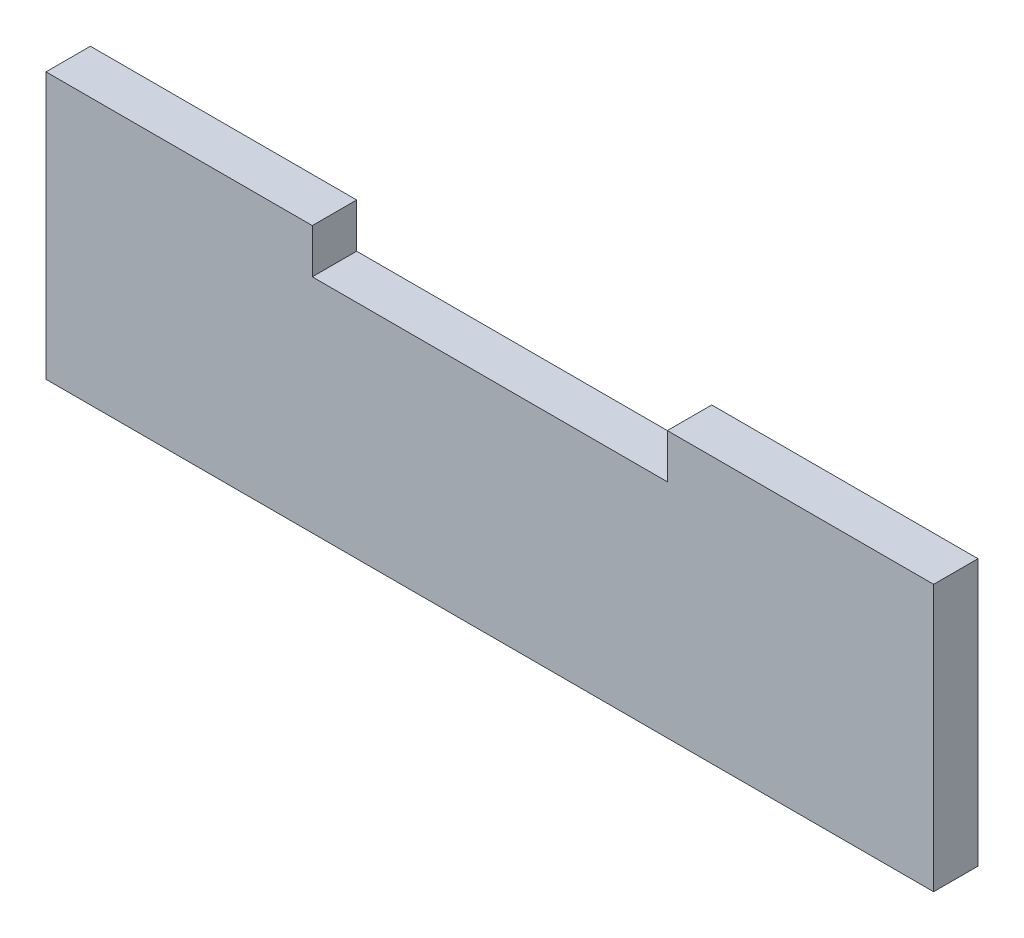
ISO-10303-21;
HEADER;
FILE_DESCRIPTION(('STEP AP214'),'2;1');
FILE_NAME('part.step','',(''),(''),'','','');
FILE_SCHEMA(('AUTOMOTIVE_DESIGN { 1 0 10303 214 1 1 1 1 }'));
ENDSEC;
DATA;
#1=APPLICATION_CONTEXT('core data for automotive mechanical design processes');
#2=APPLICATION_PROTOCOL_DEFINITION('international standard','automotive_design',2000,#1);
#3=PRODUCT_CONTEXT('',#1,'mechanical');
#4=PRODUCT('Part','Part','',(#3));
#5=PRODUCT_RELATED_PRODUCT_CATEGORY('part','',(#4));
#6=PRODUCT_DEFINITION_FORMATION('','',#4);
#7=PRODUCT_DEFINITION_CONTEXT('part definition',#1,'design');
#8=PRODUCT_DEFINITION('design','',#6,#7);
#9=PRODUCT_DEFINITION_SHAPE('','',#8);
#10=(LENGTH_UNIT() NAMED_UNIT(*) SI_UNIT(.MILLI.,.METRE.));
#11=(NAMED_UNIT(*) PLANE_ANGLE_UNIT() SI_UNIT($,.RADIAN.));
#12=(NAMED_UNIT(*) SI_UNIT($,.STERADIAN.) SOLID_ANGLE_UNIT());
#13=UNCERTAINTY_MEASURE_WITH_UNIT(LENGTH_MEASURE(1.E-05),#10,'distance_accuracy_value','');
#14=(GEOMETRIC_REPRESENTATION_CONTEXT(3) GLOBAL_UNCERTAINTY_ASSIGNED_CONTEXT((#13)) GLOBAL_UNIT_ASSIGNED_CONTEXT((#10,
#11,#12)) REPRESENTATION_CONTEXT('',''));
#15=CARTESIAN_POINT('',(0.,0.,0.));
#16=DIRECTION('',(0.,0.,1.));
#17=DIRECTION('',(1.,0.,0.));
#18=AXIS2_PLACEMENT_3D('',#15,#16,#17);
#19=CARTESIAN_POINT('',(20.,15.,5.));
#20=DIRECTION('',(0.,-1.,0.));
#21=DIRECTION('',(1.,0.,0.));
#22=AXIS2_PLACEMENT_3D('',#19,#20,#21);
#23=PLANE('',#22);
#24=DIRECTION('',(-1.,0.,0.));
#25=VECTOR('',#24,1.);
#26=CARTESIAN_POINT('',(20.,15.,0.));
#27=LINE('',#26,#25);
#28=CARTESIAN_POINT('',(50.,15.,0.));
#29=VERTEX_POINT('',#28);
#30=CARTESIAN_POINT('',(20.,15.,0.));
#31=VERTEX_POINT('',#30);
#32=EDGE_CURVE('E128',#29,#31,#27,.T.);
#33=ORIENTED_EDGE('',*,*,#32,.T.);
#34=DIRECTION('',(0.,0.,-1.));
#35=VECTOR('',#34,1.);
#36=CARTESIAN_POINT('',(20.,15.,5.));
#37=LINE('',#36,#35);
#38=CARTESIAN_POINT('',(20.,15.,5.));
#39=VERTEX_POINT('',#38);
#40=EDGE_CURVE('E11',#39,#31,#37,.T.);
#41=ORIENTED_EDGE('',*,*,#40,.F.);
#42=DIRECTION('',(-1.,0.,0.));
#43=VECTOR('',#42,1.);
#44=CARTESIAN_POINT('',(20.,15.,5.));
#45=LINE('',#44,#43);
#46=CARTESIAN_POINT('',(50.,15.,5.));
#47=VERTEX_POINT('',#46);
#48=EDGE_CURVE('E142',#47,#39,#45,.T.);
#49=ORIENTED_EDGE('',*,*,#48,.F.);
#50=DIRECTION('',(0.,0.,-1.));
#51=VECTOR('',#50,1.);
#52=CARTESIAN_POINT('',(50.,15.,5.));
#53=LINE('',#52,#51);
#54=EDGE_CURVE('E124',#47,#29,#53,.T.);
#55=ORIENTED_EDGE('',*,*,#54,.T.);
#56=EDGE_LOOP('',(#33,#41,#49,#55));
#57=FACE_BOUND('',#56,.T.);
#58=ADVANCED_FACE('F32',(#57),#23,.F.);
#59=CARTESIAN_POINT('',(20.,9.99999999999999,5.));
#60=DIRECTION('',(1.,0.,0.));
#61=DIRECTION('',(0.,0.,-1.));
#62=AXIS2_PLACEMENT_3D('',#59,#60,#61);
#63=PLANE('',#62);
#64=DIRECTION('',(0.,-1.,0.));
#65=VECTOR('',#64,1.);
#66=CARTESIAN_POINT('',(20.,9.99999999999999,0.));
#67=LINE('',#66,#65);
#68=CARTESIAN_POINT('',(20.,9.99999999999999,0.));
#69=VERTEX_POINT('',#68);
#70=EDGE_CURVE('E131',#31,#69,#67,.T.);
#71=ORIENTED_EDGE('',*,*,#70,.T.);
#72=DIRECTION('',(0.,0.,-1.));
#73=VECTOR('',#72,1.);
#74=CARTESIAN_POINT('',(20.,9.99999999999999,5.));
#75=LINE('',#74,#73);
#76=CARTESIAN_POINT('',(20.,9.99999999999999,5.));
#77=VERTEX_POINT('',#76);
#78=EDGE_CURVE('E40',#77,#69,#75,.T.);
#79=ORIENTED_EDGE('',*,*,#78,.F.);
#80=DIRECTION('',(0.,-1.,0.));
#81=VECTOR('',#80,1.);
#82=CARTESIAN_POINT('',(20.,9.99999999999999,5.));
#83=LINE('',#82,#81);
#84=EDGE_CURVE('E91',#39,#77,#83,.T.);
#85=ORIENTED_EDGE('',*,*,#84,.F.);
#86=ORIENTED_EDGE('',*,*,#40,.T.);
#87=EDGE_LOOP('',(#71,#79,#85,#86));
#88=FACE_BOUND('',#87,.T.);
#89=ADVANCED_FACE('F177',(#88),#63,.F.);
#90=CARTESIAN_POINT('',(-20.,9.99999999999999,5.));
#91=DIRECTION('',(0.,-1.,0.));
#92=DIRECTION('',(0.,0.,-1.));
#93=AXIS2_PLACEMENT_3D('',#90,#91,#92);
#94=PLANE('',#93);
#95=DIRECTION('',(-1.,0.,0.));
#96=VECTOR('',#95,1.);
#97=CARTESIAN_POINT('',(-20.,9.99999999999999,0.));
#98=LINE('',#97,#96);
#99=CARTESIAN_POINT('',(-20.,9.99999999999999,0.));
#100=VERTEX_POINT('',#99);
#101=EDGE_CURVE('E133',#69,#100,#98,.T.);
#102=ORIENTED_EDGE('',*,*,#101,.T.);
#103=DIRECTION('',(0.,0.,-1.));
#104=VECTOR('',#103,1.);
#105=CARTESIAN_POINT('',(-20.,9.99999999999999,5.));
#106=LINE('',#105,#104);
#107=CARTESIAN_POINT('',(-20.,9.99999999999999,5.));
#108=VERTEX_POINT('',#107);
#109=EDGE_CURVE('E149',#108,#100,#106,.T.);
#110=ORIENTED_EDGE('',*,*,#109,.F.);
#111=DIRECTION('',(-1.,0.,0.));
#112=VECTOR('',#111,1.);
#113=CARTESIAN_POINT('',(-20.,9.99999999999999,5.));
#114=LINE('',#113,#112);
#115=EDGE_CURVE('E157',#77,#108,#114,.T.);
#116=ORIENTED_EDGE('',*,*,#115,.F.);
#117=ORIENTED_EDGE('',*,*,#78,.T.);
#118=EDGE_LOOP('',(#102,#110,#116,#117));
#119=FACE_BOUND('',#118,.T.);
#120=ADVANCED_FACE('F155',(#119),#94,.F.);
#121=CARTESIAN_POINT('',(-20.,15.,5.));
#122=DIRECTION('',(-1.,0.,0.));
#123=DIRECTION('',(0.,0.,1.));
#124=AXIS2_PLACEMENT_3D('',#121,#122,#123);
#125=PLANE('',#124);
#126=DIRECTION('',(0.,1.,0.));
#127=VECTOR('',#126,1.);
#128=CARTESIAN_POINT('',(-20.,15.,0.));
#129=LINE('',#128,#127);
#130=CARTESIAN_POINT('',(-20.,15.,0.));
#131=VERTEX_POINT('',#130);
#132=EDGE_CURVE('E135',#100,#131,#129,.T.);
#133=ORIENTED_EDGE('',*,*,#132,.T.);
#134=DIRECTION('',(0.,0.,-1.));
#135=VECTOR('',#134,1.);
#136=CARTESIAN_POINT('',(-20.,15.,5.));
#137=LINE('',#136,#135);
#138=CARTESIAN_POINT('',(-20.,15.,5.));
#139=VERTEX_POINT('',#138);
#140=EDGE_CURVE('E146',#139,#131,#137,.T.);
#141=ORIENTED_EDGE('',*,*,#140,.F.);
#142=DIRECTION('',(0.,1.,0.));
#143=VECTOR('',#142,1.);
#144=CARTESIAN_POINT('',(-20.,15.,5.));
#145=LINE('',#144,#143);
#146=EDGE_CURVE('E169',#108,#139,#145,.T.);
#147=ORIENTED_EDGE('',*,*,#146,.F.);
#148=ORIENTED_EDGE('',*,*,#109,.T.);
#149=EDGE_LOOP('',(#133,#141,#147,#148));
#150=FACE_BOUND('',#149,.T.);
#151=ADVANCED_FACE('F165',(#150),#125,.F.);
#152=CARTESIAN_POINT('',(-50.,15.,5.));
#153=DIRECTION('',(0.,-1.,0.));
#154=DIRECTION('',(1.,0.,0.));
#155=AXIS2_PLACEMENT_3D('',#152,#153,#154);
#156=PLANE('',#155);
#157=DIRECTION('',(-1.,0.,0.));
#158=VECTOR('',#157,1.);
#159=CARTESIAN_POINT('',(-50.,15.,0.));
#160=LINE('',#159,#158);
#161=CARTESIAN_POINT('',(-50.,15.,0.));
#162=VERTEX_POINT('',#161);
#163=EDGE_CURVE('E137',#131,#162,#160,.T.);
#164=ORIENTED_EDGE('',*,*,#163,.T.);
#165=DIRECTION('',(0.,0.,-1.));
#166=VECTOR('',#165,1.);
#167=CARTESIAN_POINT('',(-50.,15.,5.));
#168=LINE('',#167,#166);
#169=CARTESIAN_POINT('',(-50.,15.,5.));
#170=VERTEX_POINT('',#169);
#171=EDGE_CURVE('E119',#170,#162,#168,.T.);
#172=ORIENTED_EDGE('',*,*,#171,.F.);
#173=DIRECTION('',(-1.,0.,0.));
#174=VECTOR('',#173,1.);
#175=CARTESIAN_POINT('',(-50.,15.,5.));
#176=LINE('',#175,#174);
#177=EDGE_CURVE('E110',#139,#170,#176,.T.);
#178=ORIENTED_EDGE('',*,*,#177,.F.);
#179=ORIENTED_EDGE('',*,*,#140,.T.);
#180=EDGE_LOOP('',(#164,#172,#178,#179));
#181=FACE_BOUND('',#180,.T.);
#182=ADVANCED_FACE('F168',(#181),#156,.F.);
#183=CARTESIAN_POINT('',(-50.,-15.,5.));
#184=DIRECTION('',(1.,0.,0.));
#185=DIRECTION('',(0.,0.,-1.));
#186=AXIS2_PLACEMENT_3D('',#183,#184,#185);
#187=PLANE('',#186);
#188=DIRECTION('',(0.,-1.,0.));
#189=VECTOR('',#188,1.);
#190=CARTESIAN_POINT('',(-50.,-15.,0.));
#191=LINE('',#190,#189);
#192=CARTESIAN_POINT('',(-50.,-15.,0.));
#193=VERTEX_POINT('',#192);
#194=EDGE_CURVE('E118',#162,#193,#191,.T.);
#195=ORIENTED_EDGE('',*,*,#194,.T.);
#196=DIRECTION('',(0.,0.,-1.));
#197=VECTOR('',#196,1.);
#198=CARTESIAN_POINT('',(-50.,-15.,5.));
#199=LINE('',#198,#197);
#200=CARTESIAN_POINT('',(-50.,-15.,5.));
#201=VERTEX_POINT('',#200);
#202=EDGE_CURVE('E115',#201,#193,#199,.T.);
#203=ORIENTED_EDGE('',*,*,#202,.F.);
#204=DIRECTION('',(0.,-1.,0.));
#205=VECTOR('',#204,1.);
#206=CARTESIAN_POINT('',(-50.,-15.,5.));
#207=LINE('',#206,#205);
#208=EDGE_CURVE('E104',#170,#201,#207,.T.);
#209=ORIENTED_EDGE('',*,*,#208,.F.);
#210=ORIENTED_EDGE('',*,*,#171,.T.);
#211=EDGE_LOOP('',(#195,#203,#209,#210));
#212=FACE_BOUND('',#211,.T.);
#213=ADVANCED_FACE('F116',(#212),#187,.F.);
#214=CARTESIAN_POINT('',(-50.,-15.,5.));
#215=DIRECTION('',(0.,1.,0.));
#216=DIRECTION('',(0.,0.,1.));
#217=AXIS2_PLACEMENT_3D('',#214,#215,#216);
#218=PLANE('',#217);
#219=DIRECTION('',(1.,0.,0.));
#220=VECTOR('',#219,1.);
#221=CARTESIAN_POINT('',(-50.,-15.,0.));
#222=LINE('',#221,#220);
#223=CARTESIAN_POINT('',(50.,-15.,0.));
#224=VERTEX_POINT('',#223);
#225=EDGE_CURVE('E77',#193,#224,#222,.T.);
#226=ORIENTED_EDGE('',*,*,#225,.T.);
#227=DIRECTION('',(0.,0.,-1.));
#228=VECTOR('',#227,1.);
#229=CARTESIAN_POINT('',(50.,-15.,5.));
#230=LINE('',#229,#228);
#231=CARTESIAN_POINT('',(50.,-15.,5.));
#232=VERTEX_POINT('',#231);
#233=EDGE_CURVE('E120',#232,#224,#230,.T.);
#234=ORIENTED_EDGE('',*,*,#233,.F.);
#235=DIRECTION('',(1.,0.,0.));
#236=VECTOR('',#235,1.);
#237=CARTESIAN_POINT('',(-50.,-15.,5.));
#238=LINE('',#237,#236);
#239=EDGE_CURVE('E108',#201,#232,#238,.T.);
#240=ORIENTED_EDGE('',*,*,#239,.F.);
#241=ORIENTED_EDGE('',*,*,#202,.T.);
#242=EDGE_LOOP('',(#226,#234,#240,#241));
#243=FACE_BOUND('',#242,.T.);
#244=ADVANCED_FACE('F122',(#243),#218,.F.);
#245=CARTESIAN_POINT('',(50.,-15.,5.));
#246=DIRECTION('',(-1.,0.,0.));
#247=DIRECTION('',(0.,0.,1.));
#248=AXIS2_PLACEMENT_3D('',#245,#246,#247);
#249=PLANE('',#248);
#250=DIRECTION('',(0.,1.,0.));
#251=VECTOR('',#250,1.);
#252=CARTESIAN_POINT('',(50.,-15.,0.));
#253=LINE('',#252,#251);
#254=EDGE_CURVE('E83',#224,#29,#253,.T.);
#255=ORIENTED_EDGE('',*,*,#254,.T.);
#256=ORIENTED_EDGE('',*,*,#54,.F.);
#257=DIRECTION('',(0.,1.,0.));
#258=VECTOR('',#257,1.);
#259=CARTESIAN_POINT('',(50.,-15.,5.));
#260=LINE('',#259,#258);
#261=EDGE_CURVE('E48',#232,#47,#260,.T.);
#262=ORIENTED_EDGE('',*,*,#261,.F.);
#263=ORIENTED_EDGE('',*,*,#233,.T.);
#264=EDGE_LOOP('',(#255,#256,#262,#263));
#265=FACE_BOUND('',#264,.T.);
#266=ADVANCED_FACE('F193',(#265),#249,.F.);
#267=CARTESIAN_POINT('',(0.,0.,5.));
#268=DIRECTION('',(0.,0.,1.));
#269=DIRECTION('',(1.,0.,0.));
#270=AXIS2_PLACEMENT_3D('',#267,#268,#269);
#271=PLANE('',#270);
#272=ORIENTED_EDGE('',*,*,#48,.T.);
#273=ORIENTED_EDGE('',*,*,#84,.T.);
#274=ORIENTED_EDGE('',*,*,#115,.T.);
#275=ORIENTED_EDGE('',*,*,#146,.T.);
#276=ORIENTED_EDGE('',*,*,#177,.T.);
#277=ORIENTED_EDGE('',*,*,#208,.T.);
#278=ORIENTED_EDGE('',*,*,#239,.T.);
#279=ORIENTED_EDGE('',*,*,#261,.T.);
#280=EDGE_LOOP('',(#272,#273,#274,#275,#276,#277,#278,#279));
#281=FACE_BOUND('',#280,.T.);
#282=ADVANCED_FACE('F106',(#281),#271,.T.);
#283=CARTESIAN_POINT('',(0.,0.,0.));
#284=DIRECTION('',(0.,0.,1.));
#285=DIRECTION('',(1.,0.,0.));
#286=AXIS2_PLACEMENT_3D('',#283,#284,#285);
#287=PLANE('',#286);
#288=ORIENTED_EDGE('',*,*,#32,.F.);
#289=ORIENTED_EDGE('',*,*,#254,.F.);
#290=ORIENTED_EDGE('',*,*,#225,.F.);
#291=ORIENTED_EDGE('',*,*,#194,.F.);
#292=ORIENTED_EDGE('',*,*,#163,.F.);
#293=ORIENTED_EDGE('',*,*,#132,.F.);
#294=ORIENTED_EDGE('',*,*,#101,.F.);
#295=ORIENTED_EDGE('',*,*,#70,.F.);
#296=EDGE_LOOP('',(#288,#289,#290,#291,#292,#293,#294,#295));
#297=FACE_BOUND('',#296,.T.);
#298=ADVANCED_FACE('F161',(#297),#287,.F.);
#299=CLOSED_SHELL('',(#58,#89,#120,#151,#182,#213,#244,#266,#282,#298));
#300=MANIFOLD_SOLID_BREP('B2',#299);
#301=ADVANCED_BREP_SHAPE_REPRESENTATION('',(#18,#300),#14);
#302=SHAPE_DEFINITION_REPRESENTATION(#9,#301);
ENDSEC;
END-ISO-10303-21;
